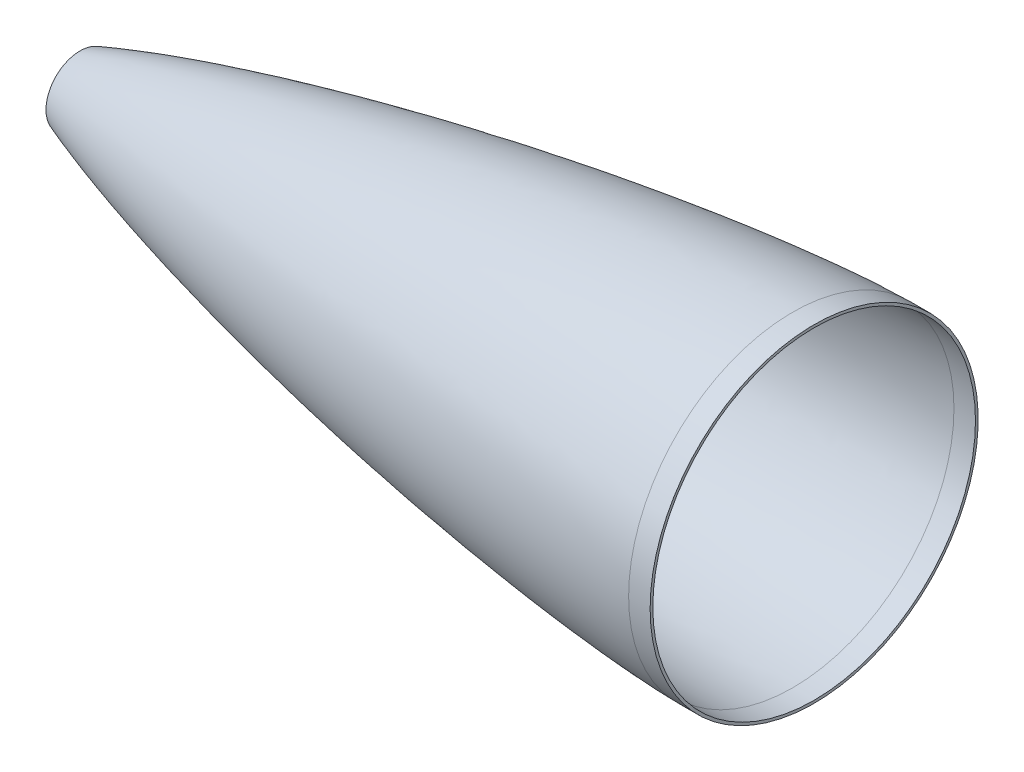
ISO-10303-21;
HEADER;
FILE_DESCRIPTION(('STEP AP214'),'2;1');
FILE_NAME('part.step','',(''),(''),'','','');
FILE_SCHEMA(('AUTOMOTIVE_DESIGN { 1 0 10303 214 1 1 1 1 }'));
ENDSEC;
DATA;
#1=APPLICATION_CONTEXT('core data for automotive mechanical design processes');
#2=APPLICATION_PROTOCOL_DEFINITION('international standard','automotive_design',2000,#1);
#3=PRODUCT_CONTEXT('',#1,'mechanical');
#4=PRODUCT('Part','Part','',(#3));
#5=PRODUCT_RELATED_PRODUCT_CATEGORY('part','',(#4));
#6=PRODUCT_DEFINITION_FORMATION('','',#4);
#7=PRODUCT_DEFINITION_CONTEXT('part definition',#1,'design');
#8=PRODUCT_DEFINITION('design','',#6,#7);
#9=PRODUCT_DEFINITION_SHAPE('','',#8);
#10=(LENGTH_UNIT() NAMED_UNIT(*) SI_UNIT(.MILLI.,.METRE.));
#11=(NAMED_UNIT(*) PLANE_ANGLE_UNIT() SI_UNIT($,.RADIAN.));
#12=(NAMED_UNIT(*) SI_UNIT($,.STERADIAN.) SOLID_ANGLE_UNIT());
#13=UNCERTAINTY_MEASURE_WITH_UNIT(LENGTH_MEASURE(1.E-05),#10,'distance_accuracy_value','');
#14=(GEOMETRIC_REPRESENTATION_CONTEXT(3) GLOBAL_UNCERTAINTY_ASSIGNED_CONTEXT((#13)) GLOBAL_UNIT_ASSIGNED_CONTEXT((#10,
#11,#12)) REPRESENTATION_CONTEXT('',''));
#15=CARTESIAN_POINT('',(0.,0.,0.));
#16=DIRECTION('',(0.,0.,1.));
#17=DIRECTION('',(1.,0.,0.));
#18=AXIS2_PLACEMENT_3D('',#15,#16,#17);
#19=CARTESIAN_POINT('',(0.,0.,0.));
#20=CARTESIAN_POINT('',(0.0022614130654814,0.0125596339292187,0.));
#21=CARTESIAN_POINT('',(0.00822914946442607,0.0372713204909585,0.));
#22=CARTESIAN_POINT('',(0.0261974766944352,0.0850108023949695,0.));
#23=CARTESIAN_POINT('',(0.0705930880654768,0.176725306773919,0.));
#24=CARTESIAN_POINT('',(0.135390601800773,0.284235784533498,0.));
#25=CARTESIAN_POINT('',(0.220401302918571,0.406590083556227,0.));
#26=CARTESIAN_POINT('',(0.336037993188335,0.55654412589075,0.));
#27=CARTESIAN_POINT('',(0.508304998192314,0.760811711331563,0.));
#28=CARTESIAN_POINT('',(0.802086139915245,1.07329374197397,0.));
#29=CARTESIAN_POINT('',(1.3250808544152,1.5651693316744,0.));
#30=CARTESIAN_POINT('',(2.23811863327799,2.31922525640611,0.));
#31=CARTESIAN_POINT('',(3.82527199460683,3.46661844329685,0.));
#32=CARTESIAN_POINT('',(6.61398983168787,5.22529479812376,0.));
#33=CARTESIAN_POINT('',(11.4561201373055,7.87661771124617,0.));
#34=CARTESIAN_POINT('',(19.2936045717849,11.6017464049679,0.));
#35=CARTESIAN_POINT('',(32.6155540983632,17.1304800149878,0.));
#36=CARTESIAN_POINT('',(51.6882713192191,23.9818909953945,0.));
#37=CARTESIAN_POINT('',(75.6130579691869,31.5462124100227,0.));
#38=CARTESIAN_POINT('',(103.310212008121,39.3619752607389,0.));
#39=CARTESIAN_POINT('',(131.892371678201,46.6864265382098,0.));
#40=CARTESIAN_POINT('',(160.614305523739,53.4402971641609,0.));
#41=CARTESIAN_POINT('',(189.448153439503,59.6968672065839,0.));
#42=CARTESIAN_POINT('',(218.376688059264,65.4994445239083,0.));
#43=CARTESIAN_POINT('',(247.387631706865,70.8740216312316,0.));
#44=CARTESIAN_POINT('',(276.472706828754,75.8317963554473,0.));
#45=CARTESIAN_POINT('',(305.625866717163,80.3721875281771,0.));
#46=CARTESIAN_POINT('',(334.843049411104,84.4812168590206,0.));
#47=CARTESIAN_POINT('',(364.121565724,88.1293712678874,0.));
#48=CARTESIAN_POINT('',(389.792768775555,90.8705573634927,0.));
#49=CARTESIAN_POINT('',(411.834102605306,92.8373554171655,0.));
#50=CARTESIAN_POINT('',(428.995077346176,94.0675681736351,0.));
#51=CARTESIAN_POINT('',(440.032338734747,94.6975648897828,0.));
#52=CARTESIAN_POINT('',(448.618051981291,95.0620461420282,0.));
#53=CARTESIAN_POINT('',(453.521410507438,95.2001609428691,0.));
#54=CARTESIAN_POINT('',(455.973700483997,95.2442558624271,0.));
#55=CARTESIAN_POINT('',(457.2,95.249999999816,0.));
#56=B_SPLINE_CURVE_WITH_KNOTS('',4,(#19,#20,#21,#22,#23,#24,#25,#26,#27,#28,#29,#30,#31,#32,#33,
#34,#35,#36,#37,#38,#39,#40,#41,#42,#43,#44,#45,#46,#47,#48,#49,#50,#51,#52,#53,#54,#55),
.UNSPECIFIED.,.F.,.F.,(5,1,1,1,1,1,1,1,1,1,1,1,1,1,1,1,1,1,1,1,1,1,1,1,1,1,1,1,1,1,1,1,1,5),(0.,
0.000108243580788651,0.000216487161577302,0.000432974323154604,0.000865948646309209,
0.00117471485125389,0.00148348105619857,0.00204360380612716,0.00313868485030378,
0.00482152199168749,0.00758803504743745,0.0121115660565557,0.0197907061424975,
0.0328543492589365,0.0545295596156781,0.0859065281731349,0.142462243157027,0.205216411679363,
0.267970587735401,0.330724762524258,0.393478942174771,0.456233117849943,0.518987297782399,
0.58174147420453,0.644495651801916,0.707249831202701,0.7700040110628,0.832758188680063,
0.895512367319852,0.926889456218357,0.958266545116861,0.979133272558431,0.989566636279215,1.),.UNSPECIFIED.);
#57=CARTESIAN_POINT('',(0.,0.,0.));
#58=DIRECTION('',(-1.,0.,0.));
#59=AXIS1_PLACEMENT('',#57,#58);
#60=SURFACE_OF_REVOLUTION('',#56,#59);
#61=CARTESIAN_POINT('',(36.4869721247647,0.,0.));
#62=DIRECTION('',(-1.,0.,0.));
#63=DIRECTION('',(0.,0.,1.));
#64=AXIS2_PLACEMENT_3D('',#61,#62,#63);
#65=CIRCLE('',#64,18.4066160319153);
#66=CARTESIAN_POINT('',(36.4869721247647,0.,18.4066160319153));
#67=VERTEX_POINT('',#66);
#68=EDGE_CURVE('E54',#67,#67,#65,.T.);
#69=ORIENTED_EDGE('',*,*,#68,.T.);
#70=EDGE_LOOP('',(#69));
#71=FACE_BOUND('',#70,.T.);
#72=CARTESIAN_POINT('',(457.2,0.,0.));
#73=DIRECTION('',(-1.,0.,0.));
#74=DIRECTION('',(0.,0.,1.));
#75=AXIS2_PLACEMENT_3D('',#72,#73,#74);
#76=CIRCLE('',#75,95.249999999816);
#77=CARTESIAN_POINT('',(457.2,0.,95.249999999816));
#78=VERTEX_POINT('',#77);
#79=EDGE_CURVE('E10',#78,#78,#76,.T.);
#80=ORIENTED_EDGE('',*,*,#79,.F.);
#81=EDGE_LOOP('',(#80));
#82=FACE_BOUND('',#81,.T.);
#83=ADVANCED_FACE('F34',(#71,#82),#60,.T.);
#84=CARTESIAN_POINT('',(0.,0.,0.));
#85=DIRECTION('',(-1.,0.,0.));
#86=DIRECTION('',(0.,0.,1.));
#87=AXIS2_PLACEMENT_3D('',#84,#85,#86);
#88=CYLINDRICAL_SURFACE('',#87,95.2499999998159);
#89=CARTESIAN_POINT('',(469.896281997833,0.,0.));
#90=DIRECTION('',(-1.,0.,0.));
#91=DIRECTION('',(0.,0.,1.));
#92=AXIS2_PLACEMENT_3D('',#89,#90,#91);
#93=CIRCLE('',#92,95.2499999998158);
#94=CARTESIAN_POINT('',(469.896281997833,0.,95.2499999998158));
#95=VERTEX_POINT('',#94);
#96=EDGE_CURVE('E42',#95,#95,#93,.T.);
#97=ORIENTED_EDGE('',*,*,#96,.F.);
#98=EDGE_LOOP('',(#97));
#99=FACE_BOUND('',#98,.T.);
#100=ORIENTED_EDGE('',*,*,#79,.T.);
#101=EDGE_LOOP('',(#100));
#102=FACE_BOUND('',#101,.T.);
#103=ADVANCED_FACE('F78',(#99,#102),#88,.F.);
#104=CARTESIAN_POINT('',(469.896281997833,96.8374999998158,0.));
#105=DIRECTION('',(1.,0.,0.));
#106=DIRECTION('',(0.,0.,-1.));
#107=AXIS2_PLACEMENT_3D('',#104,#105,#106);
#108=PLANE('',#107);
#109=ORIENTED_EDGE('',*,*,#96,.T.);
#110=EDGE_LOOP('',(#109));
#111=FACE_BOUND('',#110,.T.);
#112=CARTESIAN_POINT('',(469.896281997833,0.,0.));
#113=DIRECTION('',(-1.,0.,0.));
#114=DIRECTION('',(0.,0.,1.));
#115=AXIS2_PLACEMENT_3D('',#112,#113,#114);
#116=CIRCLE('',#115,96.8374999998158);
#117=CARTESIAN_POINT('',(469.896281997833,0.,96.8374999998158));
#118=VERTEX_POINT('',#117);
#119=EDGE_CURVE('E46',#118,#118,#116,.T.);
#120=ORIENTED_EDGE('',*,*,#119,.F.);
#121=EDGE_LOOP('',(#120));
#122=FACE_BOUND('',#121,.T.);
#123=ADVANCED_FACE('F75',(#111,#122),#108,.T.);
#124=CARTESIAN_POINT('',(0.,0.,0.));
#125=DIRECTION('',(-1.,0.,0.));
#126=DIRECTION('',(0.,0.,1.));
#127=AXIS2_PLACEMENT_3D('',#124,#125,#126);
#128=CYLINDRICAL_SURFACE('',#127,96.8374999998158);
#129=ORIENTED_EDGE('',*,*,#119,.T.);
#130=EDGE_LOOP('',(#129));
#131=FACE_BOUND('',#130,.T.);
#132=CARTESIAN_POINT('',(457.196281997955,0.,0.));
#133=DIRECTION('',(-1.,0.,0.));
#134=DIRECTION('',(0.,0.,1.));
#135=AXIS2_PLACEMENT_3D('',#132,#133,#134);
#136=CIRCLE('',#135,96.8374999998158);
#137=CARTESIAN_POINT('',(457.196281997955,0.,96.8374999998158));
#138=VERTEX_POINT('',#137);
#139=EDGE_CURVE('E51',#138,#138,#136,.T.);
#140=ORIENTED_EDGE('',*,*,#139,.F.);
#141=EDGE_LOOP('',(#140));
#142=FACE_BOUND('',#141,.T.);
#143=ADVANCED_FACE('F71',(#131,#142),#128,.T.);
#144=CARTESIAN_POINT('',(-1.8988635195333,-1.58749999999973,0.));
#145=CARTESIAN_POINT('',(-1.87155078804619,-1.43580815991917,0.));
#146=CARTESIAN_POINT('',(-1.8169252491731,-1.13242420038949,0.));
#147=CARTESIAN_POINT('',(-1.74864370507614,-0.753195647820135,0.));
#148=CARTESIAN_POINT('',(-1.69401767286031,-0.449809872394886,0.));
#149=CARTESIAN_POINT('',(-1.65987820532388,-0.260200397757149,0.));
#150=CARTESIAN_POINT('',(-1.63256250429297,-0.108497627382096,0.));
#151=CARTESIAN_POINT('',(-1.61208702796602,0.00523785940642933,0.));
#152=CARTESIAN_POINT('',(-1.59498818579019,0.100149738929054,0.));
#153=CARTESIAN_POINT('',(-1.58138973089451,0.175782500766288,0.));
#154=CARTESIAN_POINT('',(-1.57270712209059,0.223728677767297,0.));
#155=CARTESIAN_POINT('',(-1.56699716699316,0.255936942141819,0.));
#156=CARTESIAN_POINT('',(-1.56363857115118,0.273894792144512,0.));
#157=CARTESIAN_POINT('',(-1.56253016616346,0.281172055823337,0.));
#158=CARTESIAN_POINT('',(-1.54113804979801,0.391845853443557,0.));
#159=CARTESIAN_POINT('',(-1.50674816232071,0.514869843246504,0.));
#160=CARTESIAN_POINT('',(-1.44100629690577,0.695544344753535,0.));
#161=CARTESIAN_POINT('',(-1.38864523254324,0.80611301436334,0.));
#162=CARTESIAN_POINT('',(-1.30580104513051,0.968259163737305,0.));
#163=CARTESIAN_POINT('',(-1.21316871348656,1.12085725154449,0.));
#164=CARTESIAN_POINT('',(-1.07281739896483,1.32957752254996,0.));
#165=CARTESIAN_POINT('',(-0.905983241687513,1.54685181488623,0.));
#166=CARTESIAN_POINT('',(-0.710549211796525,1.77673249766394,0.));
#167=CARTESIAN_POINT('',(-0.517438480454658,1.98659794376991,0.));
#168=CARTESIAN_POINT('',(-0.260869397235511,2.24869657150614,0.));
#169=CARTESIAN_POINT('',(0.0592408816477868,2.55150621273806,0.));
#170=CARTESIAN_POINT('',(0.444273304777573,2.8897755074486,0.));
#171=CARTESIAN_POINT('',(0.960794746973389,3.31752068991702,0.));
#172=CARTESIAN_POINT('',(1.61110798947005,3.81784795861161,0.));
#173=CARTESIAN_POINT('',(2.39994555286946,4.38286964198111,0.));
#174=CARTESIAN_POINT('',(3.45996321759919,5.09973513049088,0.));
#175=CARTESIAN_POINT('',(4.80095586720482,5.94461061003513,0.));
#176=CARTESIAN_POINT('',(6.97048626046402,7.21845109920945,0.));
#177=CARTESIAN_POINT('',(9.72043765160885,8.70257726874549,0.));
#178=CARTESIAN_POINT('',(13.0594887758611,10.3683356323804,0.));
#179=CARTESIAN_POINT('',(17.5542270762077,12.4745520491104,0.));
#180=CARTESIAN_POINT('',(23.2313304024944,14.9369880347463,0.));
#181=CARTESIAN_POINT('',(30.1092825748315,17.7034272823243,0.));
#182=CARTESIAN_POINT('',(37.0346642221073,20.3245317926581,0.));
#183=CARTESIAN_POINT('',(43.9987397153019,22.8278221106581,0.));
#184=CARTESIAN_POINT('',(53.3258780232841,26.0316734218683,0.));
#185=CARTESIAN_POINT('',(65.048289721627,29.8249485891403,0.));
#186=CARTESIAN_POINT('',(79.1924615956002,34.1097519320128,0.));
#187=CARTESIAN_POINT('',(93.3976330246534,38.1716401780891,0.));
#188=CARTESIAN_POINT('',(107.653121857872,42.0420216160528,0.));
#189=CARTESIAN_POINT('',(121.951053653451,45.7432846151016,0.));
#190=CARTESIAN_POINT('',(141.064458448439,50.4742737966146,0.));
#191=CARTESIAN_POINT('',(165.037769069586,56.0378039041121,0.));
#192=CARTESIAN_POINT('',(193.911776008194,62.2236635004534,0.));
#193=CARTESIAN_POINT('',(222.876667342992,67.9594650534426,0.));
#194=CARTESIAN_POINT('',(251.921664640337,73.2689811950204,0.));
#195=CARTESIAN_POINT('',(281.039554233752,78.161617776879,0.));
#196=CARTESIAN_POINT('',(310.225321027699,82.6346916818355,0.));
#197=CARTESIAN_POINT('',(339.4758704973,86.6720576894235,0.));
#198=CARTESIAN_POINT('',(368.790008375234,90.2400780554469,0.));
#199=CARTESIAN_POINT('',(393.271656318083,92.7731676661746,0.));
#200=CARTESIAN_POINT('',(412.891914508016,94.4772401807735,0.));
#201=CARTESIAN_POINT('',(427.62440506531,95.5656977908775,0.));
#202=CARTESIAN_POINT('',(439.924064116557,96.2849685629779,0.));
#203=CARTESIAN_POINT('',(449.769524011643,96.6874567687058,0.));
#204=CARTESIAN_POINT('',(454.722638140256,96.8259131484924,0.));
#205=CARTESIAN_POINT('',(457.196281997955,96.8374999998158,0.));
#206=B_SPLINE_CURVE_WITH_KNOTS('',3,(#144,#145,#146,#147,#148,#149,#150,#151,#152,#153,#154,
#155,#156,#157,#158,#159,#160,#161,#162,#163,#164,#165,#166,#167,#168,#169,#170,#171,#172,#173,
#174,#175,#176,#177,#178,#179,#180,#181,#182,#183,#184,#185,#186,#187,#188,#189,#190,#191,#192,
#193,#194,#195,#196,#197,#198,#199,#200,#201,#202,#203,#204,#205),.UNSPECIFIED.,.F.,.F.,(4,1,1,
1,1,1,1,1,1,1,1,1,1,1,1,1,1,1,1,1,1,1,1,1,1,1,1,1,1,1,1,1,1,1,1,1,1,1,1,1,1,1,1,1,1,1,1,1,1,1,1,
1,1,1,1,1,1,1,1,4),(-0.00402652905397361,-0.00304602667393163,-0.00206552429388966,
-0.00157527310386867,-0.00108502191384769,-0.000839896318837193,-0.000594770723826699,
-0.000349645128816206,-0.000227082331310959,-0.000104519533805712,-4.32381350530887E-05,
-1.2597435676777E-05,2.72291401137887E-06,1.80432636995347E-05,7.93246624521581E-05,
0.000140606061204781,0.000263168858710028,0.000385731656215275,0.000630857251225769,
0.000875982846236262,0.00136623403625725,0.00185648522627824,0.00234673641629922,
0.00283698760632021,0.00381748998636218,0.00479799236640416,0.00577849474644613,
0.00773949950653008,0.00970050426661403,0.011661509026698,0.0155835185468659,0.0195055280670338,
0.0273495471073696,0.0351935661477054,0.0430375851880411,0.0587256232687127,0.0744136613493843,
0.0901016994300559,0.105789737510727,0.121477775591399,0.152853851752742,0.184229927914085,
0.215606004075429,0.246982080236772,0.278358156398115,0.309734232559458,0.372486384882144,
0.435238537204831,0.497990689527517,0.560742841850203,0.62349499417289,0.686247146495576,
0.748999298818263,0.811751451140949,0.874503603463635,0.905879679624978,0.937255755786321,
0.968631831947665,0.984319870028336,1.00000790810901),.UNSPECIFIED.);
#207=CARTESIAN_POINT('',(0.,0.,0.));
#208=DIRECTION('',(-1.,0.,0.));
#209=AXIS1_PLACEMENT('',#207,#208);
#210=SURFACE_OF_REVOLUTION('',#206,#209);
#211=CARTESIAN_POINT('',(36.4869721247647,0.,0.));
#212=DIRECTION('',(-1.,0.,0.));
#213=DIRECTION('',(0.,0.,1.));
#214=AXIS2_PLACEMENT_3D('',#211,#212,#213);
#215=CIRCLE('',#214,20.1000272515861);
#216=CARTESIAN_POINT('',(36.4869721247647,0.,20.1000272515861));
#217=VERTEX_POINT('',#216);
#218=EDGE_CURVE('E38',#217,#217,#215,.T.);
#219=ORIENTED_EDGE('',*,*,#218,.F.);
#220=EDGE_LOOP('',(#219));
#221=FACE_BOUND('',#220,.T.);
#222=ORIENTED_EDGE('',*,*,#139,.T.);
#223=EDGE_LOOP('',(#222));
#224=FACE_BOUND('',#223,.T.);
#225=ADVANCED_FACE('F66',(#221,#224),#210,.F.);
#226=CARTESIAN_POINT('',(36.4869721247647,0.,0.));
#227=DIRECTION('',(1.,0.,0.));
#228=DIRECTION('',(0.,0.,-1.));
#229=AXIS2_PLACEMENT_3D('',#226,#227,#228);
#230=PLANE('',#229);
#231=ORIENTED_EDGE('',*,*,#218,.T.);
#232=EDGE_LOOP('',(#231));
#233=FACE_BOUND('',#232,.T.);
#234=ORIENTED_EDGE('',*,*,#68,.F.);
#235=EDGE_LOOP('',(#234));
#236=FACE_BOUND('',#235,.T.);
#237=ADVANCED_FACE('F70',(#233,#236),#230,.F.);
#238=CLOSED_SHELL('',(#83,#103,#123,#143,#225,#237));
#239=MANIFOLD_SOLID_BREP('B2',#238);
#240=ADVANCED_BREP_SHAPE_REPRESENTATION('',(#18,#239),#14);
#241=SHAPE_DEFINITION_REPRESENTATION(#9,#240);
ENDSEC;
END-ISO-10303-21;
